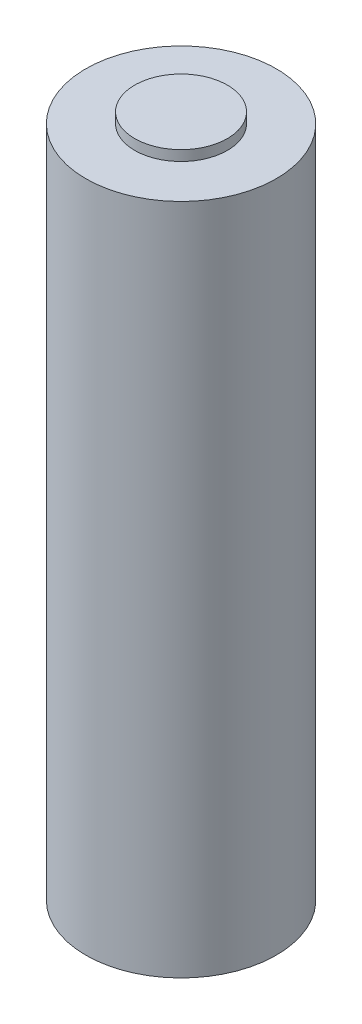
ISO-10303-21;
HEADER;
FILE_DESCRIPTION(('STEP AP214'),'2;1');
FILE_NAME('part.step','',(''),(''),'','','');
FILE_SCHEMA(('AUTOMOTIVE_DESIGN { 1 0 10303 214 1 1 1 1 }'));
ENDSEC;
DATA;
#1=APPLICATION_CONTEXT('core data for automotive mechanical design processes');
#2=APPLICATION_PROTOCOL_DEFINITION('international standard','automotive_design',2000,#1);
#3=PRODUCT_CONTEXT('',#1,'mechanical');
#4=PRODUCT('Part','Part','',(#3));
#5=PRODUCT_RELATED_PRODUCT_CATEGORY('part','',(#4));
#6=PRODUCT_DEFINITION_FORMATION('','',#4);
#7=PRODUCT_DEFINITION_CONTEXT('part definition',#1,'design');
#8=PRODUCT_DEFINITION('design','',#6,#7);
#9=PRODUCT_DEFINITION_SHAPE('','',#8);
#10=(LENGTH_UNIT() NAMED_UNIT(*) SI_UNIT(.MILLI.,.METRE.));
#11=(NAMED_UNIT(*) PLANE_ANGLE_UNIT() SI_UNIT($,.RADIAN.));
#12=(NAMED_UNIT(*) SI_UNIT($,.STERADIAN.) SOLID_ANGLE_UNIT());
#13=UNCERTAINTY_MEASURE_WITH_UNIT(LENGTH_MEASURE(1.E-05),#10,'distance_accuracy_value','');
#14=(GEOMETRIC_REPRESENTATION_CONTEXT(3) GLOBAL_UNCERTAINTY_ASSIGNED_CONTEXT((#13)) GLOBAL_UNIT_ASSIGNED_CONTEXT((#10,
#11,#12)) REPRESENTATION_CONTEXT('',''));
#15=CARTESIAN_POINT('',(0.,0.,0.));
#16=DIRECTION('',(0.,0.,1.));
#17=DIRECTION('',(1.,0.,0.));
#18=AXIS2_PLACEMENT_3D('',#15,#16,#17);
#19=CARTESIAN_POINT('',(0.,65.3,0.));
#20=DIRECTION('',(0.,-1.,0.));
#21=DIRECTION('',(0.,0.,-1.));
#22=AXIS2_PLACEMENT_3D('',#19,#20,#21);
#23=CYLINDRICAL_SURFACE('',#22,9.25);
#24=CARTESIAN_POINT('',(0.,65.3,0.));
#25=DIRECTION('',(0.,1.,0.));
#26=DIRECTION('',(0.,0.,1.));
#27=AXIS2_PLACEMENT_3D('',#24,#25,#26);
#28=CIRCLE('',#27,9.25);
#29=CARTESIAN_POINT('',(0.,65.3,9.25));
#30=VERTEX_POINT('',#29);
#31=EDGE_CURVE('E42',#30,#30,#28,.T.);
#32=ORIENTED_EDGE('',*,*,#31,.F.);
#33=EDGE_LOOP('',(#32));
#34=FACE_BOUND('',#33,.T.);
#35=CARTESIAN_POINT('',(0.,0.,0.));
#36=DIRECTION('',(0.,1.,0.));
#37=DIRECTION('',(0.,0.,1.));
#38=AXIS2_PLACEMENT_3D('',#35,#36,#37);
#39=CIRCLE('',#38,9.25);
#40=CARTESIAN_POINT('',(0.,0.,9.25));
#41=VERTEX_POINT('',#40);
#42=EDGE_CURVE('E38',#41,#41,#39,.T.);
#43=ORIENTED_EDGE('',*,*,#42,.T.);
#44=EDGE_LOOP('',(#43));
#45=FACE_BOUND('',#44,.T.);
#46=ADVANCED_FACE('F35',(#34,#45),#23,.T.);
#47=CARTESIAN_POINT('',(0.,65.3,0.));
#48=DIRECTION('',(0.,1.,0.));
#49=DIRECTION('',(0.,0.,1.));
#50=AXIS2_PLACEMENT_3D('',#47,#48,#49);
#51=PLANE('',#50);
#52=CARTESIAN_POINT('',(0.,65.3,0.));
#53=DIRECTION('',(0.,1.,0.));
#54=DIRECTION('',(0.,0.,1.));
#55=AXIS2_PLACEMENT_3D('',#52,#53,#54);
#56=CIRCLE('',#55,4.5);
#57=CARTESIAN_POINT('',(0.,65.3,4.5));
#58=VERTEX_POINT('',#57);
#59=EDGE_CURVE('E10',#58,#58,#56,.T.);
#60=ORIENTED_EDGE('',*,*,#59,.F.);
#61=EDGE_LOOP('',(#60));
#62=FACE_BOUND('',#61,.T.);
#63=ORIENTED_EDGE('',*,*,#31,.T.);
#64=EDGE_LOOP('',(#63));
#65=FACE_BOUND('',#64,.T.);
#66=ADVANCED_FACE('F59',(#62,#65),#51,.T.);
#67=CARTESIAN_POINT('',(0.,0.,0.));
#68=DIRECTION('',(0.,1.,0.));
#69=DIRECTION('',(0.,0.,1.));
#70=AXIS2_PLACEMENT_3D('',#67,#68,#69);
#71=PLANE('',#70);
#72=ORIENTED_EDGE('',*,*,#42,.F.);
#73=EDGE_LOOP('',(#72));
#74=FACE_BOUND('',#73,.T.);
#75=ADVANCED_FACE('F56',(#74),#71,.F.);
#76=CARTESIAN_POINT('',(0.,66.3,0.));
#77=DIRECTION('',(0.,-1.,0.));
#78=DIRECTION('',(0.,0.,-1.));
#79=AXIS2_PLACEMENT_3D('',#76,#77,#78);
#80=CYLINDRICAL_SURFACE('',#79,4.5);
#81=CARTESIAN_POINT('',(0.,66.3,0.));
#82=DIRECTION('',(0.,1.,0.));
#83=DIRECTION('',(0.,0.,1.));
#84=AXIS2_PLACEMENT_3D('',#81,#82,#83);
#85=CIRCLE('',#84,4.5);
#86=CARTESIAN_POINT('',(0.,66.3,4.5));
#87=VERTEX_POINT('',#86);
#88=EDGE_CURVE('E48',#87,#87,#85,.T.);
#89=ORIENTED_EDGE('',*,*,#88,.F.);
#90=EDGE_LOOP('',(#89));
#91=FACE_BOUND('',#90,.T.);
#92=ORIENTED_EDGE('',*,*,#59,.T.);
#93=EDGE_LOOP('',(#92));
#94=FACE_BOUND('',#93,.T.);
#95=ADVANCED_FACE('F58',(#91,#94),#80,.T.);
#96=CARTESIAN_POINT('',(0.,66.3,0.));
#97=DIRECTION('',(0.,1.,0.));
#98=DIRECTION('',(0.,0.,1.));
#99=AXIS2_PLACEMENT_3D('',#96,#97,#98);
#100=PLANE('',#99);
#101=ORIENTED_EDGE('',*,*,#88,.T.);
#102=EDGE_LOOP('',(#101));
#103=FACE_BOUND('',#102,.T.);
#104=ADVANCED_FACE('F64',(#103),#100,.T.);
#105=CLOSED_SHELL('',(#46,#66,#75,#95,#104));
#106=MANIFOLD_SOLID_BREP('B2',#105);
#107=ADVANCED_BREP_SHAPE_REPRESENTATION('',(#18,#106),#14);
#108=SHAPE_DEFINITION_REPRESENTATION(#9,#107);
ENDSEC;
END-ISO-10303-21;
